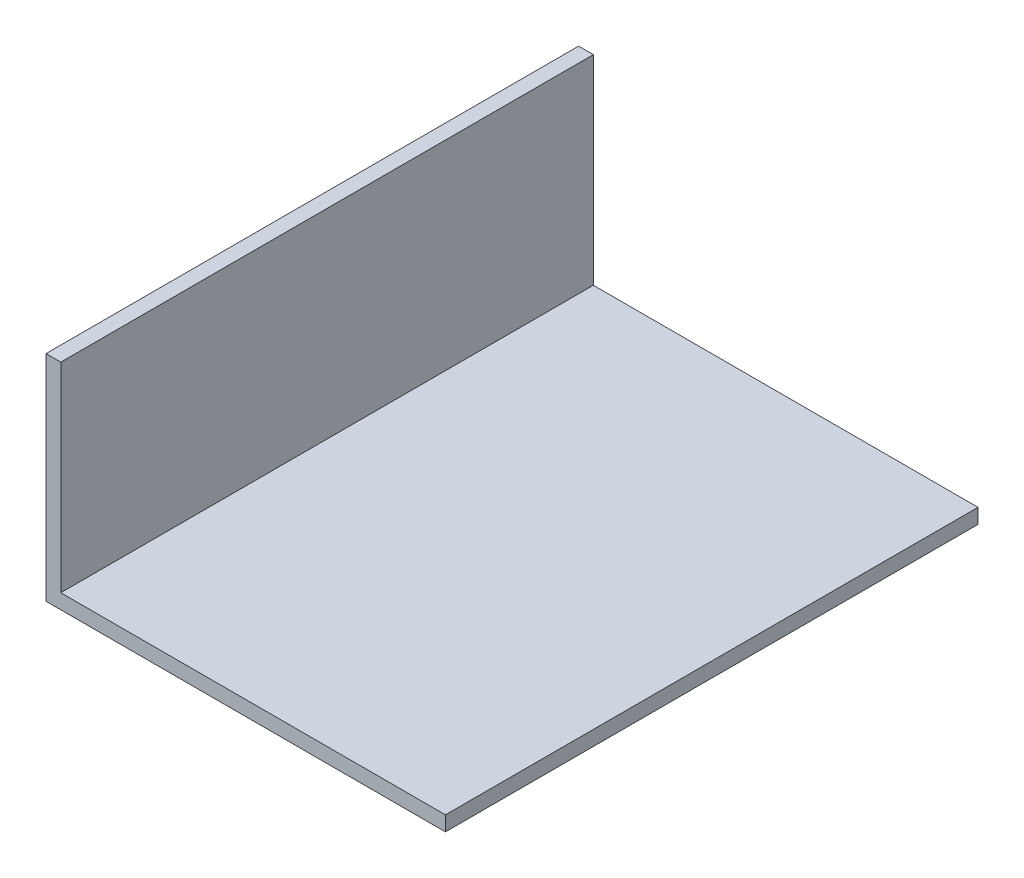
ISO-10303-21;
HEADER;
FILE_DESCRIPTION(('STEP AP214'),'2;1');
FILE_NAME('part.step','',(''),(''),'','','');
FILE_SCHEMA(('AUTOMOTIVE_DESIGN { 1 0 10303 214 1 1 1 1 }'));
ENDSEC;
DATA;
#1=APPLICATION_CONTEXT('core data for automotive mechanical design processes');
#2=APPLICATION_PROTOCOL_DEFINITION('international standard','automotive_design',2000,#1);
#3=PRODUCT_CONTEXT('',#1,'mechanical');
#4=PRODUCT('Part','Part','',(#3));
#5=PRODUCT_RELATED_PRODUCT_CATEGORY('part','',(#4));
#6=PRODUCT_DEFINITION_FORMATION('','',#4);
#7=PRODUCT_DEFINITION_CONTEXT('part definition',#1,'design');
#8=PRODUCT_DEFINITION('design','',#6,#7);
#9=PRODUCT_DEFINITION_SHAPE('','',#8);
#10=(LENGTH_UNIT() NAMED_UNIT(*) SI_UNIT(.MILLI.,.METRE.));
#11=(NAMED_UNIT(*) PLANE_ANGLE_UNIT() SI_UNIT($,.RADIAN.));
#12=(NAMED_UNIT(*) SI_UNIT($,.STERADIAN.) SOLID_ANGLE_UNIT());
#13=UNCERTAINTY_MEASURE_WITH_UNIT(LENGTH_MEASURE(1.E-05),#10,'distance_accuracy_value','');
#14=(GEOMETRIC_REPRESENTATION_CONTEXT(3) GLOBAL_UNCERTAINTY_ASSIGNED_CONTEXT((#13)) GLOBAL_UNIT_ASSIGNED_CONTEXT((#10,
#11,#12)) REPRESENTATION_CONTEXT('',''));
#15=CARTESIAN_POINT('',(0.,0.,0.));
#16=DIRECTION('',(0.,0.,1.));
#17=DIRECTION('',(1.,0.,0.));
#18=AXIS2_PLACEMENT_3D('',#15,#16,#17);
#19=CARTESIAN_POINT('',(40.,20.,72.));
#20=DIRECTION('',(0.,0.,-1.));
#21=DIRECTION('',(-1.,0.,0.));
#22=AXIS2_PLACEMENT_3D('',#19,#20,#21);
#23=PLANE('',#22);
#24=DIRECTION('',(0.,-1.,0.));
#25=VECTOR('',#24,1.);
#26=CARTESIAN_POINT('',(-38.,-18.,72.));
#27=LINE('',#26,#25);
#28=CARTESIAN_POINT('',(-38.,9.00000000000002,72.));
#29=VERTEX_POINT('',#28);
#30=CARTESIAN_POINT('',(-38.,-18.,72.));
#31=VERTEX_POINT('',#30);
#32=EDGE_CURVE('E117',#29,#31,#27,.T.);
#33=ORIENTED_EDGE('',*,*,#32,.F.);
#34=DIRECTION('',(1.,0.,0.));
#35=VECTOR('',#34,1.);
#36=CARTESIAN_POINT('',(0.,9.00000000000002,72.));
#37=LINE('',#36,#35);
#38=CARTESIAN_POINT('',(-40.,9.00000000000002,72.));
#39=VERTEX_POINT('',#38);
#40=EDGE_CURVE('E46',#39,#29,#37,.T.);
#41=ORIENTED_EDGE('',*,*,#40,.F.);
#42=DIRECTION('',(0.,-1.,0.));
#43=VECTOR('',#42,1.);
#44=CARTESIAN_POINT('',(-40.,-20.,72.));
#45=LINE('',#44,#43);
#46=CARTESIAN_POINT('',(-40.,-20.,72.));
#47=VERTEX_POINT('',#46);
#48=EDGE_CURVE('E106',#39,#47,#45,.T.);
#49=ORIENTED_EDGE('',*,*,#48,.T.);
#50=DIRECTION('',(1.,0.,0.));
#51=VECTOR('',#50,1.);
#52=CARTESIAN_POINT('',(-40.,-20.,72.));
#53=LINE('',#52,#51);
#54=CARTESIAN_POINT('',(14.,-20.,72.));
#55=VERTEX_POINT('',#54);
#56=EDGE_CURVE('E39',#47,#55,#53,.T.);
#57=ORIENTED_EDGE('',*,*,#56,.T.);
#58=DIRECTION('',(0.,-1.,0.));
#59=VECTOR('',#58,1.);
#60=CARTESIAN_POINT('',(14.,-69.7115298799416,72.));
#61=LINE('',#60,#59);
#62=CARTESIAN_POINT('',(14.,-18.,72.));
#63=VERTEX_POINT('',#62);
#64=EDGE_CURVE('E85',#63,#55,#61,.T.);
#65=ORIENTED_EDGE('',*,*,#64,.F.);
#66=DIRECTION('',(1.,0.,0.));
#67=VECTOR('',#66,1.);
#68=CARTESIAN_POINT('',(-38.,-18.,72.));
#69=LINE('',#68,#67);
#70=EDGE_CURVE('E115',#31,#63,#69,.T.);
#71=ORIENTED_EDGE('',*,*,#70,.F.);
#72=EDGE_LOOP('',(#33,#41,#49,#57,#65,#71));
#73=FACE_BOUND('',#72,.T.);
#74=ADVANCED_FACE('F31',(#73),#23,.F.);
#75=CARTESIAN_POINT('',(40.,20.,0.));
#76=DIRECTION('',(0.,0.,-1.));
#77=DIRECTION('',(-1.,0.,0.));
#78=AXIS2_PLACEMENT_3D('',#75,#76,#77);
#79=PLANE('',#78);
#80=DIRECTION('',(1.,0.,0.));
#81=VECTOR('',#80,1.);
#82=CARTESIAN_POINT('',(0.,9.00000000000002,0.));
#83=LINE('',#82,#81);
#84=CARTESIAN_POINT('',(-40.,9.00000000000002,0.));
#85=VERTEX_POINT('',#84);
#86=CARTESIAN_POINT('',(-38.,9.00000000000002,0.));
#87=VERTEX_POINT('',#86);
#88=EDGE_CURVE('E102',#85,#87,#83,.T.);
#89=ORIENTED_EDGE('',*,*,#88,.T.);
#90=DIRECTION('',(0.,-1.,0.));
#91=VECTOR('',#90,1.);
#92=CARTESIAN_POINT('',(-38.,-18.,0.));
#93=LINE('',#92,#91);
#94=CARTESIAN_POINT('',(-38.,-18.,0.));
#95=VERTEX_POINT('',#94);
#96=EDGE_CURVE('E118',#87,#95,#93,.T.);
#97=ORIENTED_EDGE('',*,*,#96,.T.);
#98=DIRECTION('',(1.,0.,0.));
#99=VECTOR('',#98,1.);
#100=CARTESIAN_POINT('',(-38.,-18.,0.));
#101=LINE('',#100,#99);
#102=CARTESIAN_POINT('',(14.,-18.,0.));
#103=VERTEX_POINT('',#102);
#104=EDGE_CURVE('E101',#95,#103,#101,.T.);
#105=ORIENTED_EDGE('',*,*,#104,.T.);
#106=DIRECTION('',(0.,-1.,0.));
#107=VECTOR('',#106,1.);
#108=CARTESIAN_POINT('',(14.,-69.7115298799416,0.));
#109=LINE('',#108,#107);
#110=CARTESIAN_POINT('',(14.,-20.,0.));
#111=VERTEX_POINT('',#110);
#112=EDGE_CURVE('E54',#103,#111,#109,.T.);
#113=ORIENTED_EDGE('',*,*,#112,.T.);
#114=DIRECTION('',(1.,0.,0.));
#115=VECTOR('',#114,1.);
#116=CARTESIAN_POINT('',(-40.,-20.,0.));
#117=LINE('',#116,#115);
#118=CARTESIAN_POINT('',(-40.,-20.,0.));
#119=VERTEX_POINT('',#118);
#120=EDGE_CURVE('E99',#119,#111,#117,.T.);
#121=ORIENTED_EDGE('',*,*,#120,.F.);
#122=DIRECTION('',(0.,-1.,0.));
#123=VECTOR('',#122,1.);
#124=CARTESIAN_POINT('',(-40.,-20.,0.));
#125=LINE('',#124,#123);
#126=EDGE_CURVE('E107',#85,#119,#125,.T.);
#127=ORIENTED_EDGE('',*,*,#126,.F.);
#128=EDGE_LOOP('',(#89,#97,#105,#113,#121,#127));
#129=FACE_BOUND('',#128,.T.);
#130=ADVANCED_FACE('F97',(#129),#79,.T.);
#131=CARTESIAN_POINT('',(-40.,-20.,72.));
#132=DIRECTION('',(1.,0.,0.));
#133=DIRECTION('',(0.,0.,-1.));
#134=AXIS2_PLACEMENT_3D('',#131,#132,#133);
#135=PLANE('',#134);
#136=ORIENTED_EDGE('',*,*,#48,.F.);
#137=DIRECTION('',(0.,0.,1.));
#138=VECTOR('',#137,1.);
#139=CARTESIAN_POINT('',(-40.,9.00000000000002,0.));
#140=LINE('',#139,#138);
#141=EDGE_CURVE('E90',#85,#39,#140,.T.);
#142=ORIENTED_EDGE('',*,*,#141,.F.);
#143=ORIENTED_EDGE('',*,*,#126,.T.);
#144=DIRECTION('',(0.,0.,-1.));
#145=VECTOR('',#144,1.);
#146=CARTESIAN_POINT('',(-40.,-20.,72.));
#147=LINE('',#146,#145);
#148=EDGE_CURVE('E11',#47,#119,#147,.T.);
#149=ORIENTED_EDGE('',*,*,#148,.F.);
#150=EDGE_LOOP('',(#136,#142,#143,#149));
#151=FACE_BOUND('',#150,.T.);
#152=ADVANCED_FACE('F33',(#151),#135,.F.);
#153=CARTESIAN_POINT('',(-40.,-20.,72.));
#154=DIRECTION('',(0.,1.,0.));
#155=DIRECTION('',(0.,0.,1.));
#156=AXIS2_PLACEMENT_3D('',#153,#154,#155);
#157=PLANE('',#156);
#158=ORIENTED_EDGE('',*,*,#120,.T.);
#159=DIRECTION('',(0.,0.,1.));
#160=VECTOR('',#159,1.);
#161=CARTESIAN_POINT('',(14.,-20.,0.));
#162=LINE('',#161,#160);
#163=EDGE_CURVE('E82',#111,#55,#162,.T.);
#164=ORIENTED_EDGE('',*,*,#163,.T.);
#165=ORIENTED_EDGE('',*,*,#56,.F.);
#166=ORIENTED_EDGE('',*,*,#148,.T.);
#167=EDGE_LOOP('',(#158,#164,#165,#166));
#168=FACE_BOUND('',#167,.T.);
#169=ADVANCED_FACE('F104',(#168),#157,.F.);
#170=CARTESIAN_POINT('',(-38.,-18.,72.));
#171=DIRECTION('',(1.,0.,0.));
#172=DIRECTION('',(0.,0.,-1.));
#173=AXIS2_PLACEMENT_3D('',#170,#171,#172);
#174=PLANE('',#173);
#175=DIRECTION('',(0.,0.,1.));
#176=VECTOR('',#175,1.);
#177=CARTESIAN_POINT('',(-38.,9.00000000000002,0.));
#178=LINE('',#177,#176);
#179=EDGE_CURVE('E120',#87,#29,#178,.T.);
#180=ORIENTED_EDGE('',*,*,#179,.T.);
#181=ORIENTED_EDGE('',*,*,#32,.T.);
#182=DIRECTION('',(0.,0.,-1.));
#183=VECTOR('',#182,1.);
#184=CARTESIAN_POINT('',(-38.,-18.,72.));
#185=LINE('',#184,#183);
#186=EDGE_CURVE('E109',#31,#95,#185,.T.);
#187=ORIENTED_EDGE('',*,*,#186,.T.);
#188=ORIENTED_EDGE('',*,*,#96,.F.);
#189=EDGE_LOOP('',(#180,#181,#187,#188));
#190=FACE_BOUND('',#189,.T.);
#191=ADVANCED_FACE('F132',(#190),#174,.T.);
#192=CARTESIAN_POINT('',(-38.,-18.,72.));
#193=DIRECTION('',(0.,1.,0.));
#194=DIRECTION('',(0.,0.,1.));
#195=AXIS2_PLACEMENT_3D('',#192,#193,#194);
#196=PLANE('',#195);
#197=DIRECTION('',(0.,0.,1.));
#198=VECTOR('',#197,1.);
#199=CARTESIAN_POINT('',(14.,-18.,0.));
#200=LINE('',#199,#198);
#201=EDGE_CURVE('E91',#103,#63,#200,.T.);
#202=ORIENTED_EDGE('',*,*,#201,.F.);
#203=ORIENTED_EDGE('',*,*,#104,.F.);
#204=ORIENTED_EDGE('',*,*,#186,.F.);
#205=ORIENTED_EDGE('',*,*,#70,.T.);
#206=EDGE_LOOP('',(#202,#203,#204,#205));
#207=FACE_BOUND('',#206,.T.);
#208=ADVANCED_FACE('F137',(#207),#196,.T.);
#209=CARTESIAN_POINT('',(14.,-69.7115298799416,0.));
#210=DIRECTION('',(-1.,0.,0.));
#211=DIRECTION('',(0.,-1.,0.));
#212=AXIS2_PLACEMENT_3D('',#209,#210,#211);
#213=PLANE('',#212);
#214=ORIENTED_EDGE('',*,*,#64,.T.);
#215=ORIENTED_EDGE('',*,*,#163,.F.);
#216=ORIENTED_EDGE('',*,*,#112,.F.);
#217=ORIENTED_EDGE('',*,*,#201,.T.);
#218=EDGE_LOOP('',(#214,#215,#216,#217));
#219=FACE_BOUND('',#218,.T.);
#220=ADVANCED_FACE('F83',(#219),#213,.F.);
#221=CARTESIAN_POINT('',(0.,9.00000000000002,0.));
#222=DIRECTION('',(0.,-1.,0.));
#223=DIRECTION('',(0.,0.,-1.));
#224=AXIS2_PLACEMENT_3D('',#221,#222,#223);
#225=PLANE('',#224);
#226=ORIENTED_EDGE('',*,*,#40,.T.);
#227=ORIENTED_EDGE('',*,*,#179,.F.);
#228=ORIENTED_EDGE('',*,*,#88,.F.);
#229=ORIENTED_EDGE('',*,*,#141,.T.);
#230=EDGE_LOOP('',(#226,#227,#228,#229));
#231=FACE_BOUND('',#230,.T.);
#232=ADVANCED_FACE('F141',(#231),#225,.F.);
#233=CLOSED_SHELL('',(#74,#130,#152,#169,#191,#208,#220,#232));
#234=MANIFOLD_SOLID_BREP('B2',#233);
#235=ADVANCED_BREP_SHAPE_REPRESENTATION('',(#18,#234),#14);
#236=SHAPE_DEFINITION_REPRESENTATION(#9,#235);
ENDSEC;
END-ISO-10303-21;
